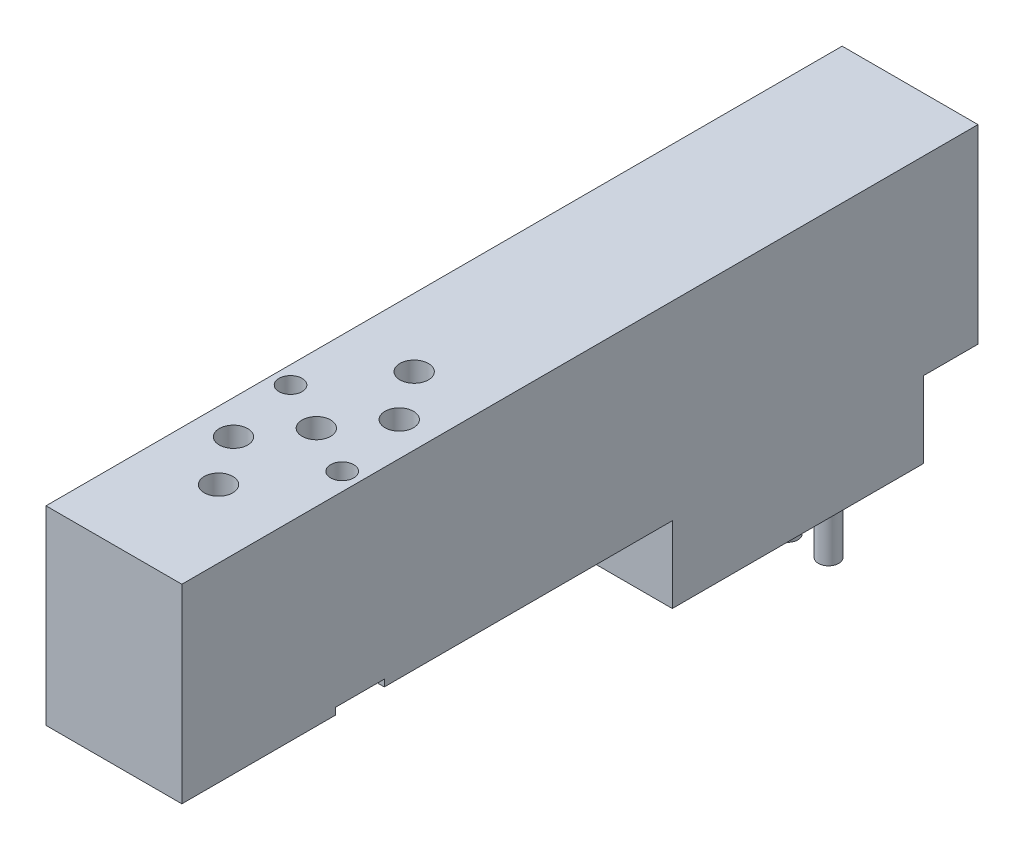
ISO-10303-21;
HEADER;
FILE_DESCRIPTION(('STEP AP214'),'2;1');
FILE_NAME('part.step','',(''),(''),'','','');
FILE_SCHEMA(('AUTOMOTIVE_DESIGN { 1 0 10303 214 1 1 1 1 }'));
ENDSEC;
DATA;
#1=APPLICATION_CONTEXT('core data for automotive mechanical design processes');
#2=APPLICATION_PROTOCOL_DEFINITION('international standard','automotive_design',2000,#1);
#3=PRODUCT_CONTEXT('',#1,'mechanical');
#4=PRODUCT('Part','Part','',(#3));
#5=PRODUCT_RELATED_PRODUCT_CATEGORY('part','',(#4));
#6=PRODUCT_DEFINITION_FORMATION('','',#4);
#7=PRODUCT_DEFINITION_CONTEXT('part definition',#1,'design');
#8=PRODUCT_DEFINITION('design','',#6,#7);
#9=PRODUCT_DEFINITION_SHAPE('','',#8);
#10=(LENGTH_UNIT() NAMED_UNIT(*) SI_UNIT(.MILLI.,.METRE.));
#11=(NAMED_UNIT(*) PLANE_ANGLE_UNIT() SI_UNIT($,.RADIAN.));
#12=(NAMED_UNIT(*) SI_UNIT($,.STERADIAN.) SOLID_ANGLE_UNIT());
#13=UNCERTAINTY_MEASURE_WITH_UNIT(LENGTH_MEASURE(1.E-05),#10,'distance_accuracy_value','');
#14=(GEOMETRIC_REPRESENTATION_CONTEXT(3) GLOBAL_UNCERTAINTY_ASSIGNED_CONTEXT((#13)) GLOBAL_UNIT_ASSIGNED_CONTEXT((#10,
#11,#12)) REPRESENTATION_CONTEXT('',''));
#15=CARTESIAN_POINT('',(0.,0.,0.));
#16=DIRECTION('',(0.,0.,1.));
#17=DIRECTION('',(1.,0.,0.));
#18=AXIS2_PLACEMENT_3D('',#15,#16,#17);
#19=CARTESIAN_POINT('',(-1.5,-20.6,7.5));
#20=DIRECTION('',(0.,-1.,0.));
#21=DIRECTION('',(0.,0.,-1.));
#22=AXIS2_PLACEMENT_3D('',#19,#20,#21);
#23=PLANE('',#22);
#24=CARTESIAN_POINT('',(-1.5,-20.6,7.5));
#25=DIRECTION('',(0.,-1.,0.));
#26=DIRECTION('',(0.,0.,-1.));
#27=AXIS2_PLACEMENT_3D('',#24,#25,#26);
#28=CIRCLE('',#27,0.75);
#29=CARTESIAN_POINT('',(-1.5,-20.6,6.75));
#30=VERTEX_POINT('',#29);
#31=EDGE_CURVE('E397',#30,#30,#28,.T.);
#32=ORIENTED_EDGE('',*,*,#31,.F.);
#33=EDGE_LOOP('',(#32));
#34=FACE_BOUND('',#33,.T.);
#35=CARTESIAN_POINT('',(1.5,-20.6,7.5));
#36=DIRECTION('',(0.,-1.,0.));
#37=DIRECTION('',(0.,0.,-1.));
#38=AXIS2_PLACEMENT_3D('',#35,#36,#37);
#39=CIRCLE('',#38,1.5);
#40=CARTESIAN_POINT('',(1.5,-20.6,6.));
#41=VERTEX_POINT('',#40);
#42=CARTESIAN_POINT('',(1.5,-20.6,9.));
#43=VERTEX_POINT('',#42);
#44=EDGE_CURVE('E373',#41,#43,#39,.T.);
#45=ORIENTED_EDGE('',*,*,#44,.T.);
#46=DIRECTION('',(-1.,0.,0.));
#47=VECTOR('',#46,1.);
#48=CARTESIAN_POINT('',(-1.5,-20.6,9.));
#49=LINE('',#48,#47);
#50=CARTESIAN_POINT('',(-1.5,-20.6,9.));
#51=VERTEX_POINT('',#50);
#52=EDGE_CURVE('E375',#43,#51,#49,.T.);
#53=ORIENTED_EDGE('',*,*,#52,.T.);
#54=CARTESIAN_POINT('',(-1.5,-20.6,7.5));
#55=DIRECTION('',(0.,-1.,0.));
#56=DIRECTION('',(0.,0.,-1.));
#57=AXIS2_PLACEMENT_3D('',#54,#55,#56);
#58=CIRCLE('',#57,1.5);
#59=CARTESIAN_POINT('',(-1.5,-20.6,6.));
#60=VERTEX_POINT('',#59);
#61=EDGE_CURVE('E365',#51,#60,#58,.T.);
#62=ORIENTED_EDGE('',*,*,#61,.T.);
#63=DIRECTION('',(1.,0.,0.));
#64=VECTOR('',#63,1.);
#65=CARTESIAN_POINT('',(1.5,-20.6,6.));
#66=LINE('',#65,#64);
#67=EDGE_CURVE('E371',#60,#41,#66,.T.);
#68=ORIENTED_EDGE('',*,*,#67,.T.);
#69=EDGE_LOOP('',(#45,#53,#62,#68));
#70=FACE_BOUND('',#69,.T.);
#71=CARTESIAN_POINT('',(1.5,-20.6,7.5));
#72=DIRECTION('',(0.,-1.,0.));
#73=DIRECTION('',(0.,0.,-1.));
#74=AXIS2_PLACEMENT_3D('',#71,#72,#73);
#75=CIRCLE('',#74,0.75);
#76=CARTESIAN_POINT('',(1.5,-20.6,6.75));
#77=VERTEX_POINT('',#76);
#78=EDGE_CURVE('E403',#77,#77,#75,.T.);
#79=ORIENTED_EDGE('',*,*,#78,.F.);
#80=EDGE_LOOP('',(#79));
#81=FACE_BOUND('',#80,.T.);
#82=ADVANCED_FACE('F31',(#34,#70,#81),#23,.T.);
#83=CARTESIAN_POINT('',(5.,-19.6,22.5));
#84=DIRECTION('',(0.,1.,0.));
#85=DIRECTION('',(0.,0.,1.));
#86=AXIS2_PLACEMENT_3D('',#83,#84,#85);
#87=PLANE('',#86);
#88=DIRECTION('',(-1.,0.,0.));
#89=VECTOR('',#88,1.);
#90=CARTESIAN_POINT('',(5.,-19.6,22.5));
#91=LINE('',#90,#89);
#92=CARTESIAN_POINT('',(5.,-19.6,22.5));
#93=VERTEX_POINT('',#92);
#94=CARTESIAN_POINT('',(-5.,-19.6,22.5));
#95=VERTEX_POINT('',#94);
#96=EDGE_CURVE('E354',#93,#95,#91,.T.);
#97=ORIENTED_EDGE('',*,*,#96,.T.);
#98=DIRECTION('',(0.,0.,-1.));
#99=VECTOR('',#98,1.);
#100=CARTESIAN_POINT('',(-5.,-19.6,22.5));
#101=LINE('',#100,#99);
#102=CARTESIAN_POINT('',(-5.,-19.6,4.));
#103=VERTEX_POINT('',#102);
#104=EDGE_CURVE('E320',#95,#103,#101,.T.);
#105=ORIENTED_EDGE('',*,*,#104,.T.);
#106=DIRECTION('',(-1.,0.,0.));
#107=VECTOR('',#106,1.);
#108=CARTESIAN_POINT('',(5.,-19.6,4.));
#109=LINE('',#108,#107);
#110=CARTESIAN_POINT('',(5.,-19.6,4.));
#111=VERTEX_POINT('',#110);
#112=EDGE_CURVE('E352',#111,#103,#109,.T.);
#113=ORIENTED_EDGE('',*,*,#112,.F.);
#114=DIRECTION('',(0.,0.,-1.));
#115=VECTOR('',#114,1.);
#116=CARTESIAN_POINT('',(5.,-19.6,22.5));
#117=LINE('',#116,#115);
#118=EDGE_CURVE('E342',#93,#111,#117,.T.);
#119=ORIENTED_EDGE('',*,*,#118,.F.);
#120=EDGE_LOOP('',(#97,#105,#113,#119));
#121=FACE_BOUND('',#120,.T.);
#122=CARTESIAN_POINT('',(-1.5,-19.6,7.5));
#123=DIRECTION('',(0.,-1.,0.));
#124=DIRECTION('',(0.,0.,-1.));
#125=AXIS2_PLACEMENT_3D('',#122,#123,#124);
#126=CIRCLE('',#125,2.);
#127=CARTESIAN_POINT('',(-1.5,-19.6,9.5));
#128=VERTEX_POINT('',#127);
#129=CARTESIAN_POINT('',(-1.5,-19.6,5.5));
#130=VERTEX_POINT('',#129);
#131=EDGE_CURVE('E182',#128,#130,#126,.T.);
#132=ORIENTED_EDGE('',*,*,#131,.F.);
#133=DIRECTION('',(-1.,0.,0.));
#134=VECTOR('',#133,1.);
#135=CARTESIAN_POINT('',(-1.5,-19.6,9.5));
#136=LINE('',#135,#134);
#137=CARTESIAN_POINT('',(1.5,-19.6,9.5));
#138=VERTEX_POINT('',#137);
#139=EDGE_CURVE('E189',#138,#128,#136,.T.);
#140=ORIENTED_EDGE('',*,*,#139,.F.);
#141=CARTESIAN_POINT('',(1.5,-19.6,7.5));
#142=DIRECTION('',(0.,-1.,0.));
#143=DIRECTION('',(0.,0.,1.));
#144=AXIS2_PLACEMENT_3D('',#141,#142,#143);
#145=CIRCLE('',#144,2.);
#146=CARTESIAN_POINT('',(1.5,-19.6,5.5));
#147=VERTEX_POINT('',#146);
#148=EDGE_CURVE('E202',#147,#138,#145,.T.);
#149=ORIENTED_EDGE('',*,*,#148,.F.);
#150=DIRECTION('',(1.,0.,0.));
#151=VECTOR('',#150,1.);
#152=CARTESIAN_POINT('',(-1.5,-19.6,5.5));
#153=LINE('',#152,#151);
#154=EDGE_CURVE('E198',#130,#147,#153,.T.);
#155=ORIENTED_EDGE('',*,*,#154,.F.);
#156=EDGE_LOOP('',(#132,#140,#149,#155));
#157=FACE_BOUND('',#156,.T.);
#158=ADVANCED_FACE('F194',(#121,#157),#87,.F.);
#159=CARTESIAN_POINT('',(3.7,0.,45.5));
#160=DIRECTION('',(0.,-1.,0.));
#161=DIRECTION('',(0.,0.,-1.));
#162=AXIS2_PLACEMENT_3D('',#159,#160,#161);
#163=CYLINDRICAL_SURFACE('',#162,0.850000000000005);
#164=CARTESIAN_POINT('',(3.7,0.,45.5));
#165=DIRECTION('',(0.,-1.,0.));
#166=DIRECTION('',(0.,0.,-1.));
#167=AXIS2_PLACEMENT_3D('',#164,#165,#166);
#168=CIRCLE('',#167,0.850000000000005);
#169=CARTESIAN_POINT('',(3.7,0.,44.65));
#170=VERTEX_POINT('',#169);
#171=EDGE_CURVE('E298',#170,#170,#168,.T.);
#172=ORIENTED_EDGE('',*,*,#171,.F.);
#173=EDGE_LOOP('',(#172));
#174=FACE_BOUND('',#173,.T.);
#175=CARTESIAN_POINT('',(3.7,-13.5,45.5));
#176=DIRECTION('',(0.,-1.,0.));
#177=DIRECTION('',(0.,0.,-1.));
#178=AXIS2_PLACEMENT_3D('',#175,#176,#177);
#179=CIRCLE('',#178,0.850000000000005);
#180=CARTESIAN_POINT('',(3.7,-13.5,44.65));
#181=VERTEX_POINT('',#180);
#182=EDGE_CURVE('E263',#181,#181,#179,.F.);
#183=ORIENTED_EDGE('',*,*,#182,.F.);
#184=EDGE_LOOP('',(#183));
#185=FACE_BOUND('',#184,.T.);
#186=ADVANCED_FACE('F417',(#174,#185),#163,.F.);
#187=CARTESIAN_POINT('',(5.,-14.,0.));
#188=DIRECTION('',(0.,0.,1.));
#189=DIRECTION('',(1.,0.,0.));
#190=AXIS2_PLACEMENT_3D('',#187,#188,#189);
#191=PLANE('',#190);
#192=DIRECTION('',(-1.,0.,0.));
#193=VECTOR('',#192,1.);
#194=CARTESIAN_POINT('',(5.,-14.,0.));
#195=LINE('',#194,#193);
#196=CARTESIAN_POINT('',(5.,-14.,0.));
#197=VERTEX_POINT('',#196);
#198=CARTESIAN_POINT('',(-5.,-14.,0.));
#199=VERTEX_POINT('',#198);
#200=EDGE_CURVE('E348',#197,#199,#195,.T.);
#201=ORIENTED_EDGE('',*,*,#200,.T.);
#202=DIRECTION('',(0.,1.,0.));
#203=VECTOR('',#202,1.);
#204=CARTESIAN_POINT('',(-5.,-14.,0.));
#205=LINE('',#204,#203);
#206=CARTESIAN_POINT('',(-5.,0.,0.));
#207=VERTEX_POINT('',#206);
#208=EDGE_CURVE('E304',#199,#207,#205,.T.);
#209=ORIENTED_EDGE('',*,*,#208,.T.);
#210=DIRECTION('',(-1.,0.,0.));
#211=VECTOR('',#210,1.);
#212=CARTESIAN_POINT('',(5.,0.,0.));
#213=LINE('',#212,#211);
#214=CARTESIAN_POINT('',(5.,0.,0.));
#215=VERTEX_POINT('',#214);
#216=EDGE_CURVE('E363',#215,#207,#213,.T.);
#217=ORIENTED_EDGE('',*,*,#216,.F.);
#218=DIRECTION('',(0.,1.,0.));
#219=VECTOR('',#218,1.);
#220=CARTESIAN_POINT('',(5.,-14.,0.));
#221=LINE('',#220,#219);
#222=EDGE_CURVE('E329',#197,#215,#221,.T.);
#223=ORIENTED_EDGE('',*,*,#222,.F.);
#224=EDGE_LOOP('',(#201,#209,#217,#223));
#225=FACE_BOUND('',#224,.T.);
#226=ADVANCED_FACE('F33',(#225),#191,.F.);
#227=CARTESIAN_POINT('',(5.,0.,0.));
#228=DIRECTION('',(0.,-1.,0.));
#229=DIRECTION('',(0.,0.,-1.));
#230=AXIS2_PLACEMENT_3D('',#227,#228,#229);
#231=PLANE('',#230);
#232=CARTESIAN_POINT('',(0.,0.,36.5));
#233=DIRECTION('',(0.,1.,0.));
#234=DIRECTION('',(0.,0.,1.));
#235=AXIS2_PLACEMENT_3D('',#232,#233,#234);
#236=CIRCLE('',#235,1.05);
#237=CARTESIAN_POINT('',(0.,0.,37.55));
#238=VERTEX_POINT('',#237);
#239=EDGE_CURVE('E212',#238,#238,#236,.T.);
#240=ORIENTED_EDGE('',*,*,#239,.F.);
#241=EDGE_LOOP('',(#240));
#242=FACE_BOUND('',#241,.T.);
#243=CARTESIAN_POINT('',(2.5,0.,40.1));
#244=DIRECTION('',(0.,1.,0.));
#245=DIRECTION('',(0.,0.,1.));
#246=AXIS2_PLACEMENT_3D('',#243,#244,#245);
#247=CIRCLE('',#246,1.05);
#248=CARTESIAN_POINT('',(2.5,0.,41.15));
#249=VERTEX_POINT('',#248);
#250=EDGE_CURVE('E218',#249,#249,#247,.T.);
#251=ORIENTED_EDGE('',*,*,#250,.F.);
#252=EDGE_LOOP('',(#251));
#253=FACE_BOUND('',#252,.T.);
#254=CARTESIAN_POINT('',(0.,0.,50.9));
#255=DIRECTION('',(0.,1.,0.));
#256=DIRECTION('',(0.,0.,1.));
#257=AXIS2_PLACEMENT_3D('',#254,#255,#256);
#258=CIRCLE('',#257,1.05);
#259=CARTESIAN_POINT('',(0.,0.,51.95));
#260=VERTEX_POINT('',#259);
#261=EDGE_CURVE('E224',#260,#260,#258,.T.);
#262=ORIENTED_EDGE('',*,*,#261,.F.);
#263=EDGE_LOOP('',(#262));
#264=FACE_BOUND('',#263,.T.);
#265=CARTESIAN_POINT('',(-2.5,0.,47.3));
#266=DIRECTION('',(0.,1.,0.));
#267=DIRECTION('',(0.,0.,1.));
#268=AXIS2_PLACEMENT_3D('',#265,#266,#267);
#269=CIRCLE('',#268,1.05);
#270=CARTESIAN_POINT('',(-2.5,0.,48.35));
#271=VERTEX_POINT('',#270);
#272=EDGE_CURVE('E230',#271,#271,#269,.T.);
#273=ORIENTED_EDGE('',*,*,#272,.F.);
#274=EDGE_LOOP('',(#273));
#275=FACE_BOUND('',#274,.T.);
#276=CARTESIAN_POINT('',(0.,0.,43.7));
#277=DIRECTION('',(0.,1.,0.));
#278=DIRECTION('',(0.,0.,1.));
#279=AXIS2_PLACEMENT_3D('',#276,#277,#278);
#280=CIRCLE('',#279,1.05);
#281=CARTESIAN_POINT('',(0.,0.,44.75));
#282=VERTEX_POINT('',#281);
#283=EDGE_CURVE('E236',#282,#282,#280,.T.);
#284=ORIENTED_EDGE('',*,*,#283,.F.);
#285=EDGE_LOOP('',(#284));
#286=FACE_BOUND('',#285,.T.);
#287=ORIENTED_EDGE('',*,*,#171,.T.);
#288=EDGE_LOOP('',(#287));
#289=FACE_BOUND('',#288,.T.);
#290=CARTESIAN_POINT('',(-3.7,0.,41.9));
#291=DIRECTION('',(0.,-1.,0.));
#292=DIRECTION('',(0.,0.,-1.));
#293=AXIS2_PLACEMENT_3D('',#290,#291,#292);
#294=CIRCLE('',#293,0.850000000000003);
#295=CARTESIAN_POINT('',(-3.7,0.,41.05));
#296=VERTEX_POINT('',#295);
#297=EDGE_CURVE('E301',#296,#296,#294,.T.);
#298=ORIENTED_EDGE('',*,*,#297,.T.);
#299=EDGE_LOOP('',(#298));
#300=FACE_BOUND('',#299,.T.);
#301=ORIENTED_EDGE('',*,*,#216,.T.);
#302=DIRECTION('',(0.,0.,1.));
#303=VECTOR('',#302,1.);
#304=CARTESIAN_POINT('',(-5.,0.,0.));
#305=LINE('',#304,#303);
#306=CARTESIAN_POINT('',(-5.,0.,58.6));
#307=VERTEX_POINT('',#306);
#308=EDGE_CURVE('E307',#207,#307,#305,.T.);
#309=ORIENTED_EDGE('',*,*,#308,.T.);
#310=DIRECTION('',(-1.,0.,0.));
#311=VECTOR('',#310,1.);
#312=CARTESIAN_POINT('',(5.,0.,58.6));
#313=LINE('',#312,#311);
#314=CARTESIAN_POINT('',(5.,0.,58.6));
#315=VERTEX_POINT('',#314);
#316=EDGE_CURVE('E361',#315,#307,#313,.T.);
#317=ORIENTED_EDGE('',*,*,#316,.F.);
#318=DIRECTION('',(0.,0.,1.));
#319=VECTOR('',#318,1.);
#320=CARTESIAN_POINT('',(5.,0.,0.));
#321=LINE('',#320,#319);
#322=EDGE_CURVE('E332',#215,#315,#321,.T.);
#323=ORIENTED_EDGE('',*,*,#322,.F.);
#324=EDGE_LOOP('',(#301,#309,#317,#323));
#325=FACE_BOUND('',#324,.T.);
#326=ADVANCED_FACE('F539',(#242,#253,#264,#275,#286,#289,#300,#325),#231,.F.);
#327=CARTESIAN_POINT('',(5.,0.,58.6));
#328=DIRECTION('',(0.,0.,-1.));
#329=DIRECTION('',(-1.,0.,0.));
#330=AXIS2_PLACEMENT_3D('',#327,#328,#329);
#331=PLANE('',#330);
#332=ORIENTED_EDGE('',*,*,#316,.T.);
#333=DIRECTION('',(0.,-1.,0.));
#334=VECTOR('',#333,1.);
#335=CARTESIAN_POINT('',(-5.,0.,58.6));
#336=LINE('',#335,#334);
#337=CARTESIAN_POINT('',(-5.,-14.,58.6));
#338=VERTEX_POINT('',#337);
#339=EDGE_CURVE('E310',#307,#338,#336,.T.);
#340=ORIENTED_EDGE('',*,*,#339,.T.);
#341=DIRECTION('',(-1.,0.,0.));
#342=VECTOR('',#341,1.);
#343=CARTESIAN_POINT('',(5.,-14.,58.6));
#344=LINE('',#343,#342);
#345=CARTESIAN_POINT('',(5.,-14.,58.6));
#346=VERTEX_POINT('',#345);
#347=EDGE_CURVE('E359',#346,#338,#344,.T.);
#348=ORIENTED_EDGE('',*,*,#347,.F.);
#349=DIRECTION('',(0.,-1.,0.));
#350=VECTOR('',#349,1.);
#351=CARTESIAN_POINT('',(5.,0.,58.6));
#352=LINE('',#351,#350);
#353=EDGE_CURVE('E334',#315,#346,#352,.T.);
#354=ORIENTED_EDGE('',*,*,#353,.F.);
#355=EDGE_LOOP('',(#332,#340,#348,#354));
#356=FACE_BOUND('',#355,.T.);
#357=ADVANCED_FACE('F536',(#356),#331,.F.);
#358=CARTESIAN_POINT('',(5.,-14.,58.6));
#359=DIRECTION('',(0.,1.,0.));
#360=DIRECTION('',(0.,0.,1.));
#361=AXIS2_PLACEMENT_3D('',#358,#359,#360);
#362=PLANE('',#361);
#363=CARTESIAN_POINT('',(3.7,-14.,45.5));
#364=DIRECTION('',(0.,-1.,0.));
#365=DIRECTION('',(0.,0.,-1.));
#366=AXIS2_PLACEMENT_3D('',#363,#364,#365);
#367=CIRCLE('',#366,1.8);
#368=CARTESIAN_POINT('',(3.7,-14.,47.3));
#369=VERTEX_POINT('',#368);
#370=CARTESIAN_POINT('',(3.7,-14.,43.7));
#371=VERTEX_POINT('',#370);
#372=EDGE_CURVE('E242',#369,#371,#367,.T.);
#373=ORIENTED_EDGE('',*,*,#372,.F.);
#374=DIRECTION('',(-1.,0.,0.));
#375=VECTOR('',#374,1.);
#376=CARTESIAN_POINT('',(3.7,-14.,47.3));
#377=LINE('',#376,#375);
#378=CARTESIAN_POINT('',(5.,-14.,47.3));
#379=VERTEX_POINT('',#378);
#380=EDGE_CURVE('E247',#379,#369,#377,.T.);
#381=ORIENTED_EDGE('',*,*,#380,.F.);
#382=DIRECTION('',(0.,0.,-1.));
#383=VECTOR('',#382,1.);
#384=CARTESIAN_POINT('',(5.,-14.,58.6));
#385=LINE('',#384,#383);
#386=EDGE_CURVE('E337',#346,#379,#385,.T.);
#387=ORIENTED_EDGE('',*,*,#386,.F.);
#388=ORIENTED_EDGE('',*,*,#347,.T.);
#389=DIRECTION('',(0.,0.,-1.));
#390=VECTOR('',#389,1.);
#391=CARTESIAN_POINT('',(-5.,-14.,58.6));
#392=LINE('',#391,#390);
#393=CARTESIAN_POINT('',(-5.,-14.,43.7));
#394=VERTEX_POINT('',#393);
#395=EDGE_CURVE('E314',#338,#394,#392,.T.);
#396=ORIENTED_EDGE('',*,*,#395,.T.);
#397=DIRECTION('',(-1.,0.,0.));
#398=VECTOR('',#397,1.);
#399=CARTESIAN_POINT('',(-3.7,-14.,43.7));
#400=LINE('',#399,#398);
#401=CARTESIAN_POINT('',(-3.7,-14.,43.7));
#402=VERTEX_POINT('',#401);
#403=EDGE_CURVE('E273',#402,#394,#400,.T.);
#404=ORIENTED_EDGE('',*,*,#403,.F.);
#405=CARTESIAN_POINT('',(-3.7,-14.,41.9));
#406=DIRECTION('',(0.,-1.,0.));
#407=DIRECTION('',(0.,0.,1.));
#408=AXIS2_PLACEMENT_3D('',#405,#406,#407);
#409=CIRCLE('',#408,1.8);
#410=CARTESIAN_POINT('',(-3.7,-14.,40.1));
#411=VERTEX_POINT('',#410);
#412=EDGE_CURVE('E270',#411,#402,#409,.T.);
#413=ORIENTED_EDGE('',*,*,#412,.F.);
#414=DIRECTION('',(1.,0.,0.));
#415=VECTOR('',#414,1.);
#416=CARTESIAN_POINT('',(-5.,-14.,40.1));
#417=LINE('',#416,#415);
#418=CARTESIAN_POINT('',(-5.,-14.,40.1));
#419=VERTEX_POINT('',#418);
#420=EDGE_CURVE('E275',#419,#411,#417,.T.);
#421=ORIENTED_EDGE('',*,*,#420,.F.);
#422=CARTESIAN_POINT('',(-5.,-14.,22.5));
#423=VERTEX_POINT('',#422);
#424=EDGE_CURVE('E313',#419,#423,#392,.T.);
#425=ORIENTED_EDGE('',*,*,#424,.T.);
#426=DIRECTION('',(-1.,0.,0.));
#427=VECTOR('',#426,1.);
#428=CARTESIAN_POINT('',(5.,-14.,22.5));
#429=LINE('',#428,#427);
#430=CARTESIAN_POINT('',(5.,-14.,22.5));
#431=VERTEX_POINT('',#430);
#432=EDGE_CURVE('E356',#431,#423,#429,.T.);
#433=ORIENTED_EDGE('',*,*,#432,.F.);
#434=CARTESIAN_POINT('',(5.,-14.,43.7));
#435=VERTEX_POINT('',#434);
#436=EDGE_CURVE('E336',#435,#431,#385,.T.);
#437=ORIENTED_EDGE('',*,*,#436,.F.);
#438=DIRECTION('',(1.,0.,0.));
#439=VECTOR('',#438,1.);
#440=CARTESIAN_POINT('',(5.,-14.,43.7));
#441=LINE('',#440,#439);
#442=EDGE_CURVE('E245',#371,#435,#441,.T.);
#443=ORIENTED_EDGE('',*,*,#442,.F.);
#444=EDGE_LOOP('',(#373,#381,#387,#388,#396,#404,#413,#421,#425,#433,#437,#443));
#445=FACE_BOUND('',#444,.T.);
#446=ADVANCED_FACE('F532',(#445),#362,.F.);
#447=CARTESIAN_POINT('',(5.,-14.,22.5));
#448=DIRECTION('',(0.,0.,-1.));
#449=DIRECTION('',(-1.,0.,0.));
#450=AXIS2_PLACEMENT_3D('',#447,#448,#449);
#451=PLANE('',#450);
#452=ORIENTED_EDGE('',*,*,#432,.T.);
#453=DIRECTION('',(0.,-1.,0.));
#454=VECTOR('',#453,1.);
#455=CARTESIAN_POINT('',(-5.,-14.,22.5));
#456=LINE('',#455,#454);
#457=EDGE_CURVE('E317',#423,#95,#456,.T.);
#458=ORIENTED_EDGE('',*,*,#457,.T.);
#459=ORIENTED_EDGE('',*,*,#96,.F.);
#460=DIRECTION('',(0.,-1.,0.));
#461=VECTOR('',#460,1.);
#462=CARTESIAN_POINT('',(5.,-14.,22.5));
#463=LINE('',#462,#461);
#464=EDGE_CURVE('E340',#431,#93,#463,.T.);
#465=ORIENTED_EDGE('',*,*,#464,.F.);
#466=EDGE_LOOP('',(#452,#458,#459,#465));
#467=FACE_BOUND('',#466,.T.);
#468=ADVANCED_FACE('F527',(#467),#451,.F.);
#469=CARTESIAN_POINT('',(5.,-19.6,4.));
#470=DIRECTION('',(0.,0.,1.));
#471=DIRECTION('',(1.,0.,0.));
#472=AXIS2_PLACEMENT_3D('',#469,#470,#471);
#473=PLANE('',#472);
#474=ORIENTED_EDGE('',*,*,#112,.T.);
#475=DIRECTION('',(0.,1.,0.));
#476=VECTOR('',#475,1.);
#477=CARTESIAN_POINT('',(-5.,-19.6,4.));
#478=LINE('',#477,#476);
#479=CARTESIAN_POINT('',(-5.,-14.,4.));
#480=VERTEX_POINT('',#479);
#481=EDGE_CURVE('E323',#103,#480,#478,.T.);
#482=ORIENTED_EDGE('',*,*,#481,.T.);
#483=DIRECTION('',(-1.,0.,0.));
#484=VECTOR('',#483,1.);
#485=CARTESIAN_POINT('',(5.,-14.,4.));
#486=LINE('',#485,#484);
#487=CARTESIAN_POINT('',(5.,-14.,4.));
#488=VERTEX_POINT('',#487);
#489=EDGE_CURVE('E350',#488,#480,#486,.T.);
#490=ORIENTED_EDGE('',*,*,#489,.F.);
#491=DIRECTION('',(0.,1.,0.));
#492=VECTOR('',#491,1.);
#493=CARTESIAN_POINT('',(5.,-19.6,4.));
#494=LINE('',#493,#492);
#495=EDGE_CURVE('E344',#111,#488,#494,.T.);
#496=ORIENTED_EDGE('',*,*,#495,.F.);
#497=EDGE_LOOP('',(#474,#482,#490,#496));
#498=FACE_BOUND('',#497,.T.);
#499=ADVANCED_FACE('F524',(#498),#473,.F.);
#500=CARTESIAN_POINT('',(5.,-14.,4.));
#501=DIRECTION('',(0.,1.,0.));
#502=DIRECTION('',(0.,0.,1.));
#503=AXIS2_PLACEMENT_3D('',#500,#501,#502);
#504=PLANE('',#503);
#505=ORIENTED_EDGE('',*,*,#489,.T.);
#506=DIRECTION('',(0.,0.,-1.));
#507=VECTOR('',#506,1.);
#508=CARTESIAN_POINT('',(-5.,-14.,4.));
#509=LINE('',#508,#507);
#510=EDGE_CURVE('E326',#480,#199,#509,.T.);
#511=ORIENTED_EDGE('',*,*,#510,.T.);
#512=ORIENTED_EDGE('',*,*,#200,.F.);
#513=DIRECTION('',(0.,0.,-1.));
#514=VECTOR('',#513,1.);
#515=CARTESIAN_POINT('',(5.,-14.,4.));
#516=LINE('',#515,#514);
#517=EDGE_CURVE('E346',#488,#197,#516,.T.);
#518=ORIENTED_EDGE('',*,*,#517,.F.);
#519=EDGE_LOOP('',(#505,#511,#512,#518));
#520=FACE_BOUND('',#519,.T.);
#521=ADVANCED_FACE('F520',(#520),#504,.F.);
#522=CARTESIAN_POINT('',(5.,-14.,0.));
#523=DIRECTION('',(-1.,0.,0.));
#524=DIRECTION('',(0.,0.,1.));
#525=AXIS2_PLACEMENT_3D('',#522,#523,#524);
#526=PLANE('',#525);
#527=ORIENTED_EDGE('',*,*,#386,.T.);
#528=DIRECTION('',(0.,-1.,0.));
#529=VECTOR('',#528,1.);
#530=CARTESIAN_POINT('',(5.,-13.5,47.3));
#531=LINE('',#530,#529);
#532=CARTESIAN_POINT('',(5.,-13.5,47.3));
#533=VERTEX_POINT('',#532);
#534=EDGE_CURVE('E264',#533,#379,#531,.T.);
#535=ORIENTED_EDGE('',*,*,#534,.F.);
#536=DIRECTION('',(0.,0.,1.));
#537=VECTOR('',#536,1.);
#538=CARTESIAN_POINT('',(5.,-13.5,47.3));
#539=LINE('',#538,#537);
#540=CARTESIAN_POINT('',(5.,-13.5,43.7));
#541=VERTEX_POINT('',#540);
#542=EDGE_CURVE('E255',#541,#533,#539,.T.);
#543=ORIENTED_EDGE('',*,*,#542,.F.);
#544=DIRECTION('',(0.,-1.,0.));
#545=VECTOR('',#544,1.);
#546=CARTESIAN_POINT('',(5.,-13.5,43.7));
#547=LINE('',#546,#545);
#548=EDGE_CURVE('E266',#541,#435,#547,.T.);
#549=ORIENTED_EDGE('',*,*,#548,.T.);
#550=ORIENTED_EDGE('',*,*,#436,.T.);
#551=ORIENTED_EDGE('',*,*,#464,.T.);
#552=ORIENTED_EDGE('',*,*,#118,.T.);
#553=ORIENTED_EDGE('',*,*,#495,.T.);
#554=ORIENTED_EDGE('',*,*,#517,.T.);
#555=ORIENTED_EDGE('',*,*,#222,.T.);
#556=ORIENTED_EDGE('',*,*,#322,.T.);
#557=ORIENTED_EDGE('',*,*,#353,.T.);
#558=EDGE_LOOP('',(#527,#535,#543,#549,#550,#551,#552,#553,#554,#555,#556,#557));
#559=FACE_BOUND('',#558,.T.);
#560=ADVANCED_FACE('F516',(#559),#526,.F.);
#561=CARTESIAN_POINT('',(-5.,-14.,0.));
#562=DIRECTION('',(-1.,0.,0.));
#563=DIRECTION('',(0.,0.,1.));
#564=AXIS2_PLACEMENT_3D('',#561,#562,#563);
#565=PLANE('',#564);
#566=DIRECTION('',(0.,-1.,0.));
#567=VECTOR('',#566,1.);
#568=CARTESIAN_POINT('',(-5.,-13.5,40.1));
#569=LINE('',#568,#567);
#570=CARTESIAN_POINT('',(-5.,-13.5,40.1));
#571=VERTEX_POINT('',#570);
#572=EDGE_CURVE('E292',#571,#419,#569,.T.);
#573=ORIENTED_EDGE('',*,*,#572,.F.);
#574=DIRECTION('',(0.,0.,-1.));
#575=VECTOR('',#574,1.);
#576=CARTESIAN_POINT('',(-5.,-13.5,43.7));
#577=LINE('',#576,#575);
#578=CARTESIAN_POINT('',(-5.,-13.5,43.7));
#579=VERTEX_POINT('',#578);
#580=EDGE_CURVE('E283',#579,#571,#577,.T.);
#581=ORIENTED_EDGE('',*,*,#580,.F.);
#582=DIRECTION('',(0.,-1.,0.));
#583=VECTOR('',#582,1.);
#584=CARTESIAN_POINT('',(-5.,-13.5,43.7));
#585=LINE('',#584,#583);
#586=EDGE_CURVE('E294',#579,#394,#585,.T.);
#587=ORIENTED_EDGE('',*,*,#586,.T.);
#588=ORIENTED_EDGE('',*,*,#395,.F.);
#589=ORIENTED_EDGE('',*,*,#339,.F.);
#590=ORIENTED_EDGE('',*,*,#308,.F.);
#591=ORIENTED_EDGE('',*,*,#208,.F.);
#592=ORIENTED_EDGE('',*,*,#510,.F.);
#593=ORIENTED_EDGE('',*,*,#481,.F.);
#594=ORIENTED_EDGE('',*,*,#104,.F.);
#595=ORIENTED_EDGE('',*,*,#457,.F.);
#596=ORIENTED_EDGE('',*,*,#424,.F.);
#597=EDGE_LOOP('',(#573,#581,#587,#588,#589,#590,#591,#592,#593,#594,#595,#596));
#598=FACE_BOUND('',#597,.T.);
#599=ADVANCED_FACE('F512',(#598),#565,.T.);
#600=CARTESIAN_POINT('',(-3.7,0.,41.9));
#601=DIRECTION('',(0.,-1.,0.));
#602=DIRECTION('',(0.,0.,-1.));
#603=AXIS2_PLACEMENT_3D('',#600,#601,#602);
#604=CYLINDRICAL_SURFACE('',#603,0.850000000000003);
#605=CARTESIAN_POINT('',(-3.7,-13.5,41.9));
#606=DIRECTION('',(0.,1.,0.));
#607=DIRECTION('',(0.,0.,1.));
#608=AXIS2_PLACEMENT_3D('',#605,#606,#607);
#609=CIRCLE('',#608,0.850000000000003);
#610=CARTESIAN_POINT('',(-3.7,-13.5,42.75));
#611=VERTEX_POINT('',#610);
#612=EDGE_CURVE('E291',#611,#611,#609,.F.);
#613=ORIENTED_EDGE('',*,*,#612,.T.);
#614=EDGE_LOOP('',(#613));
#615=FACE_BOUND('',#614,.T.);
#616=ORIENTED_EDGE('',*,*,#297,.F.);
#617=EDGE_LOOP('',(#616));
#618=FACE_BOUND('',#617,.T.);
#619=ADVANCED_FACE('F495',(#615,#618),#604,.F.);
#620=CARTESIAN_POINT('',(-3.7,-13.5,41.9));
#621=DIRECTION('',(0.,1.,0.));
#622=DIRECTION('',(0.,0.,1.));
#623=AXIS2_PLACEMENT_3D('',#620,#621,#622);
#624=PLANE('',#623);
#625=CARTESIAN_POINT('',(-3.7,-13.5,41.9));
#626=DIRECTION('',(0.,-1.,0.));
#627=DIRECTION('',(0.,0.,1.));
#628=AXIS2_PLACEMENT_3D('',#625,#626,#627);
#629=CIRCLE('',#628,1.8);
#630=CARTESIAN_POINT('',(-3.7,-13.5,40.1));
#631=VERTEX_POINT('',#630);
#632=CARTESIAN_POINT('',(-3.7,-13.5,43.7));
#633=VERTEX_POINT('',#632);
#634=EDGE_CURVE('E278',#631,#633,#629,.T.);
#635=ORIENTED_EDGE('',*,*,#634,.T.);
#636=DIRECTION('',(-1.,0.,0.));
#637=VECTOR('',#636,1.);
#638=CARTESIAN_POINT('',(-3.7,-13.5,43.7));
#639=LINE('',#638,#637);
#640=EDGE_CURVE('E281',#633,#579,#639,.T.);
#641=ORIENTED_EDGE('',*,*,#640,.T.);
#642=ORIENTED_EDGE('',*,*,#580,.T.);
#643=DIRECTION('',(1.,0.,0.));
#644=VECTOR('',#643,1.);
#645=CARTESIAN_POINT('',(-5.,-13.5,40.1));
#646=LINE('',#645,#644);
#647=EDGE_CURVE('E285',#571,#631,#646,.T.);
#648=ORIENTED_EDGE('',*,*,#647,.T.);
#649=EDGE_LOOP('',(#635,#641,#642,#648));
#650=FACE_BOUND('',#649,.T.);
#651=ORIENTED_EDGE('',*,*,#612,.F.);
#652=EDGE_LOOP('',(#651));
#653=FACE_BOUND('',#652,.T.);
#654=ADVANCED_FACE('F491',(#650,#653),#624,.F.);
#655=CARTESIAN_POINT('',(-3.7,-13.5,41.9));
#656=DIRECTION('',(0.,-1.,0.));
#657=DIRECTION('',(0.,0.,-1.));
#658=AXIS2_PLACEMENT_3D('',#655,#656,#657);
#659=CYLINDRICAL_SURFACE('',#658,1.8);
#660=ORIENTED_EDGE('',*,*,#412,.T.);
#661=DIRECTION('',(0.,-1.,0.));
#662=VECTOR('',#661,1.);
#663=CARTESIAN_POINT('',(-3.7,-13.5,43.7));
#664=LINE('',#663,#662);
#665=EDGE_CURVE('E288',#633,#402,#664,.T.);
#666=ORIENTED_EDGE('',*,*,#665,.F.);
#667=ORIENTED_EDGE('',*,*,#634,.F.);
#668=DIRECTION('',(0.,-1.,0.));
#669=VECTOR('',#668,1.);
#670=CARTESIAN_POINT('',(-3.7,-13.5,40.1));
#671=LINE('',#670,#669);
#672=EDGE_CURVE('E289',#631,#411,#671,.T.);
#673=ORIENTED_EDGE('',*,*,#672,.T.);
#674=EDGE_LOOP('',(#660,#666,#667,#673));
#675=FACE_BOUND('',#674,.T.);
#676=ADVANCED_FACE('F494',(#675),#659,.F.);
#677=CARTESIAN_POINT('',(-5.,-13.5,40.1));
#678=DIRECTION('',(0.,0.,-1.));
#679=DIRECTION('',(-1.,0.,0.));
#680=AXIS2_PLACEMENT_3D('',#677,#678,#679);
#681=PLANE('',#680);
#682=ORIENTED_EDGE('',*,*,#420,.T.);
#683=ORIENTED_EDGE('',*,*,#672,.F.);
#684=ORIENTED_EDGE('',*,*,#647,.F.);
#685=ORIENTED_EDGE('',*,*,#572,.T.);
#686=EDGE_LOOP('',(#682,#683,#684,#685));
#687=FACE_BOUND('',#686,.T.);
#688=ADVANCED_FACE('F497',(#687),#681,.F.);
#689=CARTESIAN_POINT('',(-3.7,-13.5,43.7));
#690=DIRECTION('',(0.,0.,1.));
#691=DIRECTION('',(1.,0.,0.));
#692=AXIS2_PLACEMENT_3D('',#689,#690,#691);
#693=PLANE('',#692);
#694=ORIENTED_EDGE('',*,*,#403,.T.);
#695=ORIENTED_EDGE('',*,*,#586,.F.);
#696=ORIENTED_EDGE('',*,*,#640,.F.);
#697=ORIENTED_EDGE('',*,*,#665,.T.);
#698=EDGE_LOOP('',(#694,#695,#696,#697));
#699=FACE_BOUND('',#698,.T.);
#700=ADVANCED_FACE('F479',(#699),#693,.F.);
#701=CARTESIAN_POINT('',(3.7,-13.5,45.5));
#702=DIRECTION('',(0.,-1.,0.));
#703=DIRECTION('',(0.,0.,-1.));
#704=AXIS2_PLACEMENT_3D('',#701,#702,#703);
#705=PLANE('',#704);
#706=CARTESIAN_POINT('',(3.7,-13.5,45.5));
#707=DIRECTION('',(0.,-1.,0.));
#708=DIRECTION('',(0.,0.,-1.));
#709=AXIS2_PLACEMENT_3D('',#706,#707,#708);
#710=CIRCLE('',#709,1.8);
#711=CARTESIAN_POINT('',(3.7,-13.5,47.3));
#712=VERTEX_POINT('',#711);
#713=CARTESIAN_POINT('',(3.7,-13.5,43.7));
#714=VERTEX_POINT('',#713);
#715=EDGE_CURVE('E250',#712,#714,#710,.T.);
#716=ORIENTED_EDGE('',*,*,#715,.T.);
#717=DIRECTION('',(1.,0.,0.));
#718=VECTOR('',#717,1.);
#719=CARTESIAN_POINT('',(5.,-13.5,43.7));
#720=LINE('',#719,#718);
#721=EDGE_CURVE('E253',#714,#541,#720,.T.);
#722=ORIENTED_EDGE('',*,*,#721,.T.);
#723=ORIENTED_EDGE('',*,*,#542,.T.);
#724=DIRECTION('',(-1.,0.,0.));
#725=VECTOR('',#724,1.);
#726=CARTESIAN_POINT('',(3.7,-13.5,47.3));
#727=LINE('',#726,#725);
#728=EDGE_CURVE('E257',#533,#712,#727,.T.);
#729=ORIENTED_EDGE('',*,*,#728,.T.);
#730=EDGE_LOOP('',(#716,#722,#723,#729));
#731=FACE_BOUND('',#730,.T.);
#732=ORIENTED_EDGE('',*,*,#182,.T.);
#733=EDGE_LOOP('',(#732));
#734=FACE_BOUND('',#733,.T.);
#735=ADVANCED_FACE('F475',(#731,#734),#705,.T.);
#736=CARTESIAN_POINT('',(3.7,-13.5,45.5));
#737=DIRECTION('',(0.,-1.,0.));
#738=DIRECTION('',(0.,0.,-1.));
#739=AXIS2_PLACEMENT_3D('',#736,#737,#738);
#740=CYLINDRICAL_SURFACE('',#739,1.8);
#741=ORIENTED_EDGE('',*,*,#372,.T.);
#742=DIRECTION('',(0.,-1.,0.));
#743=VECTOR('',#742,1.);
#744=CARTESIAN_POINT('',(3.7,-13.5,43.7));
#745=LINE('',#744,#743);
#746=EDGE_CURVE('E260',#714,#371,#745,.T.);
#747=ORIENTED_EDGE('',*,*,#746,.F.);
#748=ORIENTED_EDGE('',*,*,#715,.F.);
#749=DIRECTION('',(0.,-1.,0.));
#750=VECTOR('',#749,1.);
#751=CARTESIAN_POINT('',(3.7,-13.5,47.3));
#752=LINE('',#751,#750);
#753=EDGE_CURVE('E261',#712,#369,#752,.T.);
#754=ORIENTED_EDGE('',*,*,#753,.T.);
#755=EDGE_LOOP('',(#741,#747,#748,#754));
#756=FACE_BOUND('',#755,.T.);
#757=ADVANCED_FACE('F478',(#756),#740,.F.);
#758=CARTESIAN_POINT('',(3.7,-13.5,47.3));
#759=DIRECTION('',(0.,0.,1.));
#760=DIRECTION('',(1.,0.,0.));
#761=AXIS2_PLACEMENT_3D('',#758,#759,#760);
#762=PLANE('',#761);
#763=ORIENTED_EDGE('',*,*,#380,.T.);
#764=ORIENTED_EDGE('',*,*,#753,.F.);
#765=ORIENTED_EDGE('',*,*,#728,.F.);
#766=ORIENTED_EDGE('',*,*,#534,.T.);
#767=EDGE_LOOP('',(#763,#764,#765,#766));
#768=FACE_BOUND('',#767,.T.);
#769=ADVANCED_FACE('F481',(#768),#762,.F.);
#770=CARTESIAN_POINT('',(5.,-13.5,43.7));
#771=DIRECTION('',(0.,0.,-1.));
#772=DIRECTION('',(-1.,0.,0.));
#773=AXIS2_PLACEMENT_3D('',#770,#771,#772);
#774=PLANE('',#773);
#775=ORIENTED_EDGE('',*,*,#442,.T.);
#776=ORIENTED_EDGE('',*,*,#548,.F.);
#777=ORIENTED_EDGE('',*,*,#721,.F.);
#778=ORIENTED_EDGE('',*,*,#746,.T.);
#779=EDGE_LOOP('',(#775,#776,#777,#778));
#780=FACE_BOUND('',#779,.T.);
#781=ADVANCED_FACE('F473',(#780),#774,.F.);
#782=CARTESIAN_POINT('',(0.,-5.00000000000001,43.7));
#783=DIRECTION('',(0.,1.,0.));
#784=DIRECTION('',(0.,0.,1.));
#785=AXIS2_PLACEMENT_3D('',#782,#783,#784);
#786=CYLINDRICAL_SURFACE('',#785,1.05);
#787=CARTESIAN_POINT('',(0.,-5.00000000000001,43.7));
#788=DIRECTION('',(0.,1.,0.));
#789=DIRECTION('',(0.,0.,1.));
#790=AXIS2_PLACEMENT_3D('',#787,#788,#789);
#791=CIRCLE('',#790,1.05);
#792=CARTESIAN_POINT('',(0.,-5.00000000000001,44.75));
#793=VERTEX_POINT('',#792);
#794=EDGE_CURVE('E239',#793,#793,#791,.T.);
#795=ORIENTED_EDGE('',*,*,#794,.F.);
#796=EDGE_LOOP('',(#795));
#797=FACE_BOUND('',#796,.T.);
#798=ORIENTED_EDGE('',*,*,#283,.T.);
#799=EDGE_LOOP('',(#798));
#800=FACE_BOUND('',#799,.T.);
#801=ADVANCED_FACE('F469',(#797,#800),#786,.F.);
#802=CARTESIAN_POINT('',(0.,-5.00000000000001,43.7));
#803=DIRECTION('',(0.,1.,0.));
#804=DIRECTION('',(0.,0.,1.));
#805=AXIS2_PLACEMENT_3D('',#802,#803,#804);
#806=PLANE('',#805);
#807=ORIENTED_EDGE('',*,*,#794,.T.);
#808=EDGE_LOOP('',(#807));
#809=FACE_BOUND('',#808,.T.);
#810=ADVANCED_FACE('F465',(#809),#806,.T.);
#811=CARTESIAN_POINT('',(-2.5,-7.96984848098351,47.3));
#812=DIRECTION('',(0.,1.,0.));
#813=DIRECTION('',(0.,0.,1.));
#814=AXIS2_PLACEMENT_3D('',#811,#812,#813);
#815=CYLINDRICAL_SURFACE('',#814,1.05);
#816=CARTESIAN_POINT('',(-2.5,-5.00000000000001,47.3));
#817=DIRECTION('',(0.,1.,0.));
#818=DIRECTION('',(0.,0.,1.));
#819=AXIS2_PLACEMENT_3D('',#816,#817,#818);
#820=CIRCLE('',#819,1.05);
#821=CARTESIAN_POINT('',(-2.5,-5.00000000000001,48.35));
#822=VERTEX_POINT('',#821);
#823=EDGE_CURVE('E233',#822,#822,#820,.F.);
#824=ORIENTED_EDGE('',*,*,#823,.T.);
#825=EDGE_LOOP('',(#824));
#826=FACE_BOUND('',#825,.T.);
#827=ORIENTED_EDGE('',*,*,#272,.T.);
#828=EDGE_LOOP('',(#827));
#829=FACE_BOUND('',#828,.T.);
#830=ADVANCED_FACE('F461',(#826,#829),#815,.F.);
#831=CARTESIAN_POINT('',(0.,-5.00000000000001,43.7));
#832=DIRECTION('',(0.,1.,0.));
#833=DIRECTION('',(0.,0.,1.));
#834=AXIS2_PLACEMENT_3D('',#831,#832,#833);
#835=PLANE('',#834);
#836=ORIENTED_EDGE('',*,*,#823,.F.);
#837=EDGE_LOOP('',(#836));
#838=FACE_BOUND('',#837,.T.);
#839=ADVANCED_FACE('F457',(#838),#835,.T.);
#840=CARTESIAN_POINT('',(0.,-7.96984848098352,50.9));
#841=DIRECTION('',(0.,1.,0.));
#842=DIRECTION('',(0.,0.,1.));
#843=AXIS2_PLACEMENT_3D('',#840,#841,#842);
#844=CYLINDRICAL_SURFACE('',#843,1.05);
#845=CARTESIAN_POINT('',(0.,-5.00000000000001,50.9));
#846=DIRECTION('',(0.,1.,0.));
#847=DIRECTION('',(0.,0.,1.));
#848=AXIS2_PLACEMENT_3D('',#845,#846,#847);
#849=CIRCLE('',#848,1.05);
#850=CARTESIAN_POINT('',(0.,-5.00000000000001,51.95));
#851=VERTEX_POINT('',#850);
#852=EDGE_CURVE('E227',#851,#851,#849,.F.);
#853=ORIENTED_EDGE('',*,*,#852,.T.);
#854=EDGE_LOOP('',(#853));
#855=FACE_BOUND('',#854,.T.);
#856=ORIENTED_EDGE('',*,*,#261,.T.);
#857=EDGE_LOOP('',(#856));
#858=FACE_BOUND('',#857,.T.);
#859=ADVANCED_FACE('F453',(#855,#858),#844,.F.);
#860=CARTESIAN_POINT('',(0.,-5.00000000000001,43.7));
#861=DIRECTION('',(0.,1.,0.));
#862=DIRECTION('',(0.,0.,1.));
#863=AXIS2_PLACEMENT_3D('',#860,#861,#862);
#864=PLANE('',#863);
#865=ORIENTED_EDGE('',*,*,#852,.F.);
#866=EDGE_LOOP('',(#865));
#867=FACE_BOUND('',#866,.T.);
#868=ADVANCED_FACE('F449',(#867),#864,.T.);
#869=CARTESIAN_POINT('',(2.5,-7.96984848098351,40.1));
#870=DIRECTION('',(0.,1.,0.));
#871=DIRECTION('',(0.,0.,1.));
#872=AXIS2_PLACEMENT_3D('',#869,#870,#871);
#873=CYLINDRICAL_SURFACE('',#872,1.05);
#874=CARTESIAN_POINT('',(2.5,-5.,40.1));
#875=DIRECTION('',(0.,1.,0.));
#876=DIRECTION('',(0.,0.,1.));
#877=AXIS2_PLACEMENT_3D('',#874,#875,#876);
#878=CIRCLE('',#877,1.05);
#879=CARTESIAN_POINT('',(2.5,-5.,41.15));
#880=VERTEX_POINT('',#879);
#881=EDGE_CURVE('E221',#880,#880,#878,.F.);
#882=ORIENTED_EDGE('',*,*,#881,.T.);
#883=EDGE_LOOP('',(#882));
#884=FACE_BOUND('',#883,.T.);
#885=ORIENTED_EDGE('',*,*,#250,.T.);
#886=EDGE_LOOP('',(#885));
#887=FACE_BOUND('',#886,.T.);
#888=ADVANCED_FACE('F445',(#884,#887),#873,.F.);
#889=CARTESIAN_POINT('',(0.,-5.00000000000001,43.7));
#890=DIRECTION('',(0.,1.,0.));
#891=DIRECTION('',(0.,0.,1.));
#892=AXIS2_PLACEMENT_3D('',#889,#890,#891);
#893=PLANE('',#892);
#894=ORIENTED_EDGE('',*,*,#881,.F.);
#895=EDGE_LOOP('',(#894));
#896=FACE_BOUND('',#895,.T.);
#897=ADVANCED_FACE('F441',(#896),#893,.T.);
#898=CARTESIAN_POINT('',(0.,-7.96984848098351,36.5));
#899=DIRECTION('',(0.,1.,0.));
#900=DIRECTION('',(0.,0.,1.));
#901=AXIS2_PLACEMENT_3D('',#898,#899,#900);
#902=CYLINDRICAL_SURFACE('',#901,1.05);
#903=CARTESIAN_POINT('',(0.,-5.,36.5));
#904=DIRECTION('',(0.,1.,0.));
#905=DIRECTION('',(0.,0.,1.));
#906=AXIS2_PLACEMENT_3D('',#903,#904,#905);
#907=CIRCLE('',#906,1.05);
#908=CARTESIAN_POINT('',(0.,-5.,37.55));
#909=VERTEX_POINT('',#908);
#910=EDGE_CURVE('E215',#909,#909,#907,.F.);
#911=ORIENTED_EDGE('',*,*,#910,.T.);
#912=EDGE_LOOP('',(#911));
#913=FACE_BOUND('',#912,.T.);
#914=ORIENTED_EDGE('',*,*,#239,.T.);
#915=EDGE_LOOP('',(#914));
#916=FACE_BOUND('',#915,.T.);
#917=ADVANCED_FACE('F437',(#913,#916),#902,.F.);
#918=CARTESIAN_POINT('',(0.,-5.00000000000001,43.7));
#919=DIRECTION('',(0.,1.,0.));
#920=DIRECTION('',(0.,0.,1.));
#921=AXIS2_PLACEMENT_3D('',#918,#919,#920);
#922=PLANE('',#921);
#923=ORIENTED_EDGE('',*,*,#910,.F.);
#924=EDGE_LOOP('',(#923));
#925=FACE_BOUND('',#924,.T.);
#926=ADVANCED_FACE('F434',(#925),#922,.T.);
#927=CARTESIAN_POINT('',(-1.5,-20.6,7.5));
#928=DIRECTION('',(0.,1.,0.));
#929=DIRECTION('',(0.,0.,1.));
#930=AXIS2_PLACEMENT_3D('',#927,#928,#929);
#931=CYLINDRICAL_SURFACE('',#930,2.);
#932=DIRECTION('',(0.,1.,0.));
#933=VECTOR('',#932,1.);
#934=CARTESIAN_POINT('',(-1.5,-20.6,5.5));
#935=LINE('',#934,#933);
#936=CARTESIAN_POINT('',(-1.5,-20.1,5.5));
#937=VERTEX_POINT('',#936);
#938=EDGE_CURVE('E210',#937,#130,#935,.T.);
#939=ORIENTED_EDGE('',*,*,#938,.F.);
#940=CARTESIAN_POINT('',(-1.5,-20.1,7.5));
#941=DIRECTION('',(0.,-1.,0.));
#942=DIRECTION('',(0.,0.,-1.));
#943=AXIS2_PLACEMENT_3D('',#940,#941,#942);
#944=CIRCLE('',#943,2.);
#945=CARTESIAN_POINT('',(-1.5,-20.1,9.5));
#946=VERTEX_POINT('',#945);
#947=EDGE_CURVE('E11',#937,#946,#944,.F.);
#948=ORIENTED_EDGE('',*,*,#947,.T.);
#949=DIRECTION('',(0.,1.,0.));
#950=VECTOR('',#949,1.);
#951=CARTESIAN_POINT('',(-1.5,-20.6,9.5));
#952=LINE('',#951,#950);
#953=EDGE_CURVE('E179',#946,#128,#952,.T.);
#954=ORIENTED_EDGE('',*,*,#953,.T.);
#955=ORIENTED_EDGE('',*,*,#131,.T.);
#956=EDGE_LOOP('',(#939,#948,#954,#955));
#957=FACE_BOUND('',#956,.T.);
#958=ADVANCED_FACE('F181',(#957),#931,.T.);
#959=CARTESIAN_POINT('',(-1.5,-20.6,5.5));
#960=DIRECTION('',(0.,0.,1.));
#961=DIRECTION('',(1.,0.,0.));
#962=AXIS2_PLACEMENT_3D('',#959,#960,#961);
#963=PLANE('',#962);
#964=DIRECTION('',(0.,1.,0.));
#965=VECTOR('',#964,1.);
#966=CARTESIAN_POINT('',(1.5,-20.6,5.5));
#967=LINE('',#966,#965);
#968=CARTESIAN_POINT('',(1.5,-20.1,5.5));
#969=VERTEX_POINT('',#968);
#970=EDGE_CURVE('E208',#969,#147,#967,.T.);
#971=ORIENTED_EDGE('',*,*,#970,.F.);
#972=DIRECTION('',(1.,0.,0.));
#973=VECTOR('',#972,1.);
#974=CARTESIAN_POINT('',(-1.5,-20.1,5.5));
#975=LINE('',#974,#973);
#976=EDGE_CURVE('E39',#969,#937,#975,.F.);
#977=ORIENTED_EDGE('',*,*,#976,.T.);
#978=ORIENTED_EDGE('',*,*,#938,.T.);
#979=ORIENTED_EDGE('',*,*,#154,.T.);
#980=EDGE_LOOP('',(#971,#977,#978,#979));
#981=FACE_BOUND('',#980,.T.);
#982=ADVANCED_FACE('F383',(#981),#963,.F.);
#983=CARTESIAN_POINT('',(1.5,-20.6,7.5));
#984=DIRECTION('',(0.,1.,0.));
#985=DIRECTION('',(0.,0.,1.));
#986=AXIS2_PLACEMENT_3D('',#983,#984,#985);
#987=CYLINDRICAL_SURFACE('',#986,2.);
#988=DIRECTION('',(0.,1.,0.));
#989=VECTOR('',#988,1.);
#990=CARTESIAN_POINT('',(1.5,-20.6,9.5));
#991=LINE('',#990,#989);
#992=CARTESIAN_POINT('',(1.5,-20.1,9.5));
#993=VERTEX_POINT('',#992);
#994=EDGE_CURVE('E188',#993,#138,#991,.T.);
#995=ORIENTED_EDGE('',*,*,#994,.F.);
#996=CARTESIAN_POINT('',(1.5,-20.1,7.5));
#997=DIRECTION('',(0.,-1.,0.));
#998=DIRECTION('',(0.,0.,-1.));
#999=AXIS2_PLACEMENT_3D('',#996,#997,#998);
#1000=CIRCLE('',#999,2.);
#1001=EDGE_CURVE('E53',#993,#969,#1000,.F.);
#1002=ORIENTED_EDGE('',*,*,#1001,.T.);
#1003=ORIENTED_EDGE('',*,*,#970,.T.);
#1004=ORIENTED_EDGE('',*,*,#148,.T.);
#1005=EDGE_LOOP('',(#995,#1002,#1003,#1004));
#1006=FACE_BOUND('',#1005,.T.);
#1007=ADVANCED_FACE('F382',(#1006),#987,.T.);
#1008=CARTESIAN_POINT('',(-1.5,-20.6,9.5));
#1009=DIRECTION('',(0.,0.,-1.));
#1010=DIRECTION('',(-1.,0.,0.));
#1011=AXIS2_PLACEMENT_3D('',#1008,#1009,#1010);
#1012=PLANE('',#1011);
#1013=ORIENTED_EDGE('',*,*,#953,.F.);
#1014=DIRECTION('',(-1.,0.,0.));
#1015=VECTOR('',#1014,1.);
#1016=CARTESIAN_POINT('',(1.5,-20.1,9.5));
#1017=LINE('',#1016,#1015);
#1018=EDGE_CURVE('E378',#946,#993,#1017,.F.);
#1019=ORIENTED_EDGE('',*,*,#1018,.T.);
#1020=ORIENTED_EDGE('',*,*,#994,.T.);
#1021=ORIENTED_EDGE('',*,*,#139,.T.);
#1022=EDGE_LOOP('',(#1013,#1019,#1020,#1021));
#1023=FACE_BOUND('',#1022,.T.);
#1024=ADVANCED_FACE('F201',(#1023),#1012,.F.);
#1025=CARTESIAN_POINT('',(-1.5,-20.1,6.));
#1026=DIRECTION('',(-1.,0.,0.));
#1027=DIRECTION('',(0.,0.,1.));
#1028=AXIS2_PLACEMENT_3D('',#1025,#1026,#1027);
#1029=CYLINDRICAL_SURFACE('',#1028,0.5);
#1030=CARTESIAN_POINT('',(-1.5,-20.1,6.));
#1031=DIRECTION('',(-1.,0.,0.));
#1032=DIRECTION('',(0.,0.,1.));
#1033=AXIS2_PLACEMENT_3D('',#1030,#1031,#1032);
#1034=CIRCLE('',#1033,0.5);
#1035=EDGE_CURVE('E387',#937,#60,#1034,.T.);
#1036=ORIENTED_EDGE('',*,*,#1035,.F.);
#1037=ORIENTED_EDGE('',*,*,#976,.F.);
#1038=CARTESIAN_POINT('',(1.5,-20.1,6.));
#1039=DIRECTION('',(1.,0.,0.));
#1040=DIRECTION('',(0.,0.,-1.));
#1041=AXIS2_PLACEMENT_3D('',#1038,#1039,#1040);
#1042=CIRCLE('',#1041,0.5);
#1043=EDGE_CURVE('E199',#41,#969,#1042,.T.);
#1044=ORIENTED_EDGE('',*,*,#1043,.F.);
#1045=ORIENTED_EDGE('',*,*,#67,.F.);
#1046=EDGE_LOOP('',(#1036,#1037,#1044,#1045));
#1047=FACE_BOUND('',#1046,.T.);
#1048=ADVANCED_FACE('F424',(#1047),#1029,.T.);
#1049=CARTESIAN_POINT('',(1.5,-20.1,7.5));
#1050=DIRECTION('',(0.,-1.,0.));
#1051=DIRECTION('',(0.,0.,-1.));
#1052=AXIS2_PLACEMENT_3D('',#1049,#1050,#1051);
#1053=TOROIDAL_SURFACE('',#1052,1.5,0.5);
#1054=ORIENTED_EDGE('',*,*,#1043,.T.);
#1055=ORIENTED_EDGE('',*,*,#1001,.F.);
#1056=CARTESIAN_POINT('',(1.5,-20.1,9.));
#1057=DIRECTION('',(-1.,0.,0.));
#1058=DIRECTION('',(0.,0.,1.));
#1059=AXIS2_PLACEMENT_3D('',#1056,#1057,#1058);
#1060=CIRCLE('',#1059,0.5);
#1061=EDGE_CURVE('E390',#43,#993,#1060,.T.);
#1062=ORIENTED_EDGE('',*,*,#1061,.F.);
#1063=ORIENTED_EDGE('',*,*,#44,.F.);
#1064=EDGE_LOOP('',(#1054,#1055,#1062,#1063));
#1065=FACE_BOUND('',#1064,.T.);
#1066=ADVANCED_FACE('F752',(#1065),#1053,.T.);
#1067=CARTESIAN_POINT('',(-1.5,-20.1,7.5));
#1068=DIRECTION('',(0.,-1.,0.));
#1069=DIRECTION('',(0.,0.,-1.));
#1070=AXIS2_PLACEMENT_3D('',#1067,#1068,#1069);
#1071=TOROIDAL_SURFACE('',#1070,1.5,0.5);
#1072=ORIENTED_EDGE('',*,*,#1035,.T.);
#1073=ORIENTED_EDGE('',*,*,#61,.F.);
#1074=CARTESIAN_POINT('',(-1.5,-20.1,9.));
#1075=DIRECTION('',(1.,0.,0.));
#1076=DIRECTION('',(0.,0.,-1.));
#1077=AXIS2_PLACEMENT_3D('',#1074,#1075,#1076);
#1078=CIRCLE('',#1077,0.5);
#1079=EDGE_CURVE('E392',#946,#51,#1078,.T.);
#1080=ORIENTED_EDGE('',*,*,#1079,.F.);
#1081=ORIENTED_EDGE('',*,*,#947,.F.);
#1082=EDGE_LOOP('',(#1072,#1073,#1080,#1081));
#1083=FACE_BOUND('',#1082,.T.);
#1084=ADVANCED_FACE('F759',(#1083),#1071,.T.);
#1085=CARTESIAN_POINT('',(-1.5,-20.1,9.));
#1086=DIRECTION('',(1.,0.,0.));
#1087=DIRECTION('',(0.,0.,-1.));
#1088=AXIS2_PLACEMENT_3D('',#1085,#1086,#1087);
#1089=CYLINDRICAL_SURFACE('',#1088,0.5);
#1090=ORIENTED_EDGE('',*,*,#1061,.T.);
#1091=ORIENTED_EDGE('',*,*,#1018,.F.);
#1092=ORIENTED_EDGE('',*,*,#1079,.T.);
#1093=ORIENTED_EDGE('',*,*,#52,.F.);
#1094=EDGE_LOOP('',(#1090,#1091,#1092,#1093));
#1095=FACE_BOUND('',#1094,.T.);
#1096=ADVANCED_FACE('F766',(#1095),#1089,.T.);
#1097=CARTESIAN_POINT('',(-1.5,-25.6,7.5));
#1098=DIRECTION('',(0.,1.,0.));
#1099=DIRECTION('',(0.,0.,1.));
#1100=AXIS2_PLACEMENT_3D('',#1097,#1098,#1099);
#1101=CYLINDRICAL_SURFACE('',#1100,0.75);
#1102=CARTESIAN_POINT('',(-1.5,-25.6,7.5));
#1103=DIRECTION('',(0.,-1.,0.));
#1104=DIRECTION('',(0.,0.,-1.));
#1105=AXIS2_PLACEMENT_3D('',#1102,#1103,#1104);
#1106=CIRCLE('',#1105,0.75);
#1107=CARTESIAN_POINT('',(-1.5,-25.6,6.75));
#1108=VERTEX_POINT('',#1107);
#1109=EDGE_CURVE('E394',#1108,#1108,#1106,.T.);
#1110=ORIENTED_EDGE('',*,*,#1109,.F.);
#1111=EDGE_LOOP('',(#1110));
#1112=FACE_BOUND('',#1111,.T.);
#1113=ORIENTED_EDGE('',*,*,#31,.T.);
#1114=EDGE_LOOP('',(#1113));
#1115=FACE_BOUND('',#1114,.T.);
#1116=ADVANCED_FACE('F772',(#1112,#1115),#1101,.T.);
#1117=CARTESIAN_POINT('',(-1.5,-25.6,7.5));
#1118=DIRECTION('',(0.,-1.,0.));
#1119=DIRECTION('',(0.,0.,-1.));
#1120=AXIS2_PLACEMENT_3D('',#1117,#1118,#1119);
#1121=PLANE('',#1120);
#1122=ORIENTED_EDGE('',*,*,#1109,.T.);
#1123=EDGE_LOOP('',(#1122));
#1124=FACE_BOUND('',#1123,.T.);
#1125=ADVANCED_FACE('F781',(#1124),#1121,.T.);
#1126=CARTESIAN_POINT('',(1.5,-25.6,7.5));
#1127=DIRECTION('',(0.,1.,0.));
#1128=DIRECTION('',(0.,0.,1.));
#1129=AXIS2_PLACEMENT_3D('',#1126,#1127,#1128);
#1130=CYLINDRICAL_SURFACE('',#1129,0.75);
#1131=CARTESIAN_POINT('',(1.5,-25.6,7.5));
#1132=DIRECTION('',(0.,-1.,0.));
#1133=DIRECTION('',(0.,0.,-1.));
#1134=AXIS2_PLACEMENT_3D('',#1131,#1132,#1133);
#1135=CIRCLE('',#1134,0.75);
#1136=CARTESIAN_POINT('',(1.5,-25.6,6.75));
#1137=VERTEX_POINT('',#1136);
#1138=EDGE_CURVE('E400',#1137,#1137,#1135,.T.);
#1139=ORIENTED_EDGE('',*,*,#1138,.F.);
#1140=EDGE_LOOP('',(#1139));
#1141=FACE_BOUND('',#1140,.T.);
#1142=ORIENTED_EDGE('',*,*,#78,.T.);
#1143=EDGE_LOOP('',(#1142));
#1144=FACE_BOUND('',#1143,.T.);
#1145=ADVANCED_FACE('F407',(#1141,#1144),#1130,.T.);
#1146=CARTESIAN_POINT('',(1.5,-25.6,7.5));
#1147=DIRECTION('',(0.,-1.,0.));
#1148=DIRECTION('',(0.,0.,-1.));
#1149=AXIS2_PLACEMENT_3D('',#1146,#1147,#1148);
#1150=PLANE('',#1149);
#1151=ORIENTED_EDGE('',*,*,#1138,.T.);
#1152=EDGE_LOOP('',(#1151));
#1153=FACE_BOUND('',#1152,.T.);
#1154=ADVANCED_FACE('F796',(#1153),#1150,.T.);
#1155=CLOSED_SHELL('',(#82,#158,#186,#226,#326,#357,#446,#468,#499,#521,#560,#599,#619,#654,
#676,#688,#700,#735,#757,#769,#781,#801,#810,#830,#839,#859,#868,#888,#897,#917,#926,#958,#982,
#1007,#1024,#1048,#1066,#1084,#1096,#1116,#1125,#1145,#1154));
#1156=MANIFOLD_SOLID_BREP('B2',#1155);
#1157=ADVANCED_BREP_SHAPE_REPRESENTATION('',(#18,#1156),#14);
#1158=SHAPE_DEFINITION_REPRESENTATION(#9,#1157);
ENDSEC;
END-ISO-10303-21;
